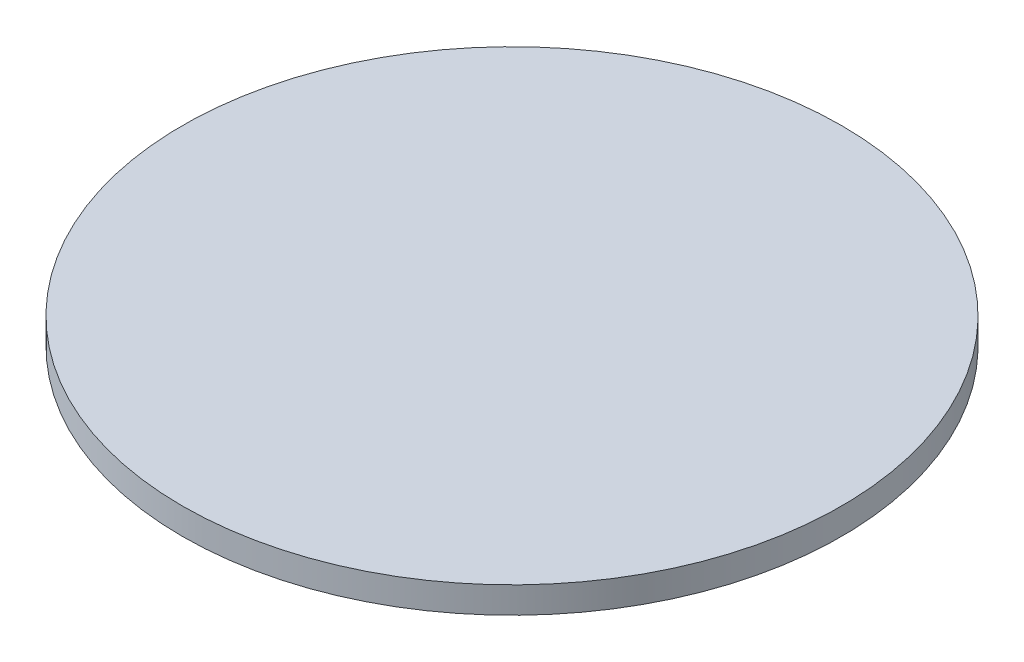
ISO-10303-21;
HEADER;
FILE_DESCRIPTION(('STEP AP214'),'2;1');
FILE_NAME('part.step','',(''),(''),'','','');
FILE_SCHEMA(('AUTOMOTIVE_DESIGN { 1 0 10303 214 1 1 1 1 }'));
ENDSEC;
DATA;
#1=APPLICATION_CONTEXT('core data for automotive mechanical design processes');
#2=APPLICATION_PROTOCOL_DEFINITION('international standard','automotive_design',2000,#1);
#3=PRODUCT_CONTEXT('',#1,'mechanical');
#4=PRODUCT('Part','Part','',(#3));
#5=PRODUCT_RELATED_PRODUCT_CATEGORY('part','',(#4));
#6=PRODUCT_DEFINITION_FORMATION('','',#4);
#7=PRODUCT_DEFINITION_CONTEXT('part definition',#1,'design');
#8=PRODUCT_DEFINITION('design','',#6,#7);
#9=PRODUCT_DEFINITION_SHAPE('','',#8);
#10=(LENGTH_UNIT() NAMED_UNIT(*) SI_UNIT(.MILLI.,.METRE.));
#11=(NAMED_UNIT(*) PLANE_ANGLE_UNIT() SI_UNIT($,.RADIAN.));
#12=(NAMED_UNIT(*) SI_UNIT($,.STERADIAN.) SOLID_ANGLE_UNIT());
#13=UNCERTAINTY_MEASURE_WITH_UNIT(LENGTH_MEASURE(1.E-05),#10,'distance_accuracy_value','');
#14=(GEOMETRIC_REPRESENTATION_CONTEXT(3) GLOBAL_UNCERTAINTY_ASSIGNED_CONTEXT((#13)) GLOBAL_UNIT_ASSIGNED_CONTEXT((#10,
#11,#12)) REPRESENTATION_CONTEXT('',''));
#15=CARTESIAN_POINT('',(0.,0.,0.));
#16=DIRECTION('',(0.,0.,1.));
#17=DIRECTION('',(1.,0.,0.));
#18=AXIS2_PLACEMENT_3D('',#15,#16,#17);
#19=CARTESIAN_POINT('',(0.,8.,0.));
#20=DIRECTION('',(0.,-1.,0.));
#21=DIRECTION('',(0.,0.,-1.));
#22=AXIS2_PLACEMENT_3D('',#19,#20,#21);
#23=CYLINDRICAL_SURFACE('',#22,100.);
#24=CARTESIAN_POINT('',(0.,8.,0.));
#25=DIRECTION('',(0.,1.,0.));
#26=DIRECTION('',(0.,0.,1.));
#27=AXIS2_PLACEMENT_3D('',#24,#25,#26);
#28=CIRCLE('',#27,100.);
#29=CARTESIAN_POINT('',(0.,8.,100.));
#30=VERTEX_POINT('',#29);
#31=EDGE_CURVE('E10',#30,#30,#28,.T.);
#32=ORIENTED_EDGE('',*,*,#31,.F.);
#33=EDGE_LOOP('',(#32));
#34=FACE_BOUND('',#33,.T.);
#35=CARTESIAN_POINT('',(0.,0.,0.));
#36=DIRECTION('',(0.,1.,0.));
#37=DIRECTION('',(0.,0.,1.));
#38=AXIS2_PLACEMENT_3D('',#35,#36,#37);
#39=CIRCLE('',#38,100.);
#40=CARTESIAN_POINT('',(0.,0.,100.));
#41=VERTEX_POINT('',#40);
#42=EDGE_CURVE('E38',#41,#41,#39,.T.);
#43=ORIENTED_EDGE('',*,*,#42,.T.);
#44=EDGE_LOOP('',(#43));
#45=FACE_BOUND('',#44,.T.);
#46=ADVANCED_FACE('F35',(#34,#45),#23,.T.);
#47=CARTESIAN_POINT('',(0.,8.,0.));
#48=DIRECTION('',(0.,1.,0.));
#49=DIRECTION('',(0.,0.,1.));
#50=AXIS2_PLACEMENT_3D('',#47,#48,#49);
#51=PLANE('',#50);
#52=ORIENTED_EDGE('',*,*,#31,.T.);
#53=EDGE_LOOP('',(#52));
#54=FACE_BOUND('',#53,.T.);
#55=ADVANCED_FACE('F50',(#54),#51,.T.);
#56=CARTESIAN_POINT('',(0.,0.,0.));
#57=DIRECTION('',(0.,1.,0.));
#58=DIRECTION('',(0.,0.,1.));
#59=AXIS2_PLACEMENT_3D('',#56,#57,#58);
#60=PLANE('',#59);
#61=ORIENTED_EDGE('',*,*,#42,.F.);
#62=EDGE_LOOP('',(#61));
#63=FACE_BOUND('',#62,.T.);
#64=ADVANCED_FACE('F48',(#63),#60,.F.);
#65=CLOSED_SHELL('',(#46,#55,#64));
#66=MANIFOLD_SOLID_BREP('B2',#65);
#67=ADVANCED_BREP_SHAPE_REPRESENTATION('',(#18,#66),#14);
#68=SHAPE_DEFINITION_REPRESENTATION(#9,#67);
ENDSEC;
END-ISO-10303-21;
